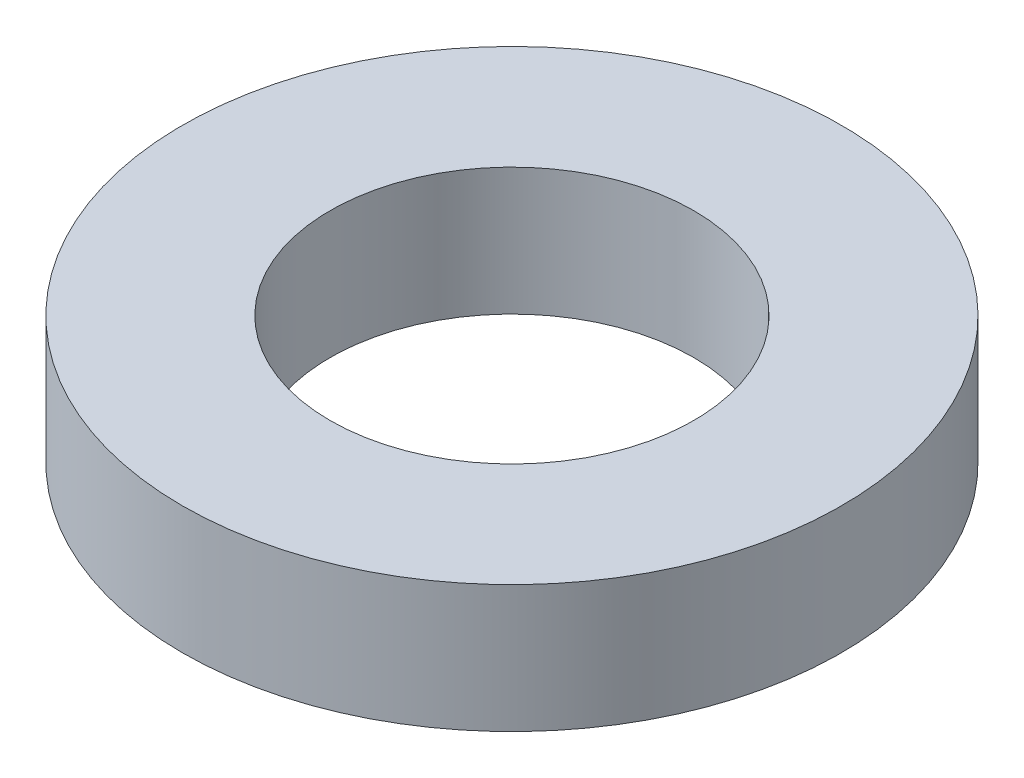
ISO-10303-21;
HEADER;
FILE_DESCRIPTION(('STEP AP214'),'2;1');
FILE_NAME('part.step','',(''),(''),'','','');
FILE_SCHEMA(('AUTOMOTIVE_DESIGN { 1 0 10303 214 1 1 1 1 }'));
ENDSEC;
DATA;
#1=APPLICATION_CONTEXT('core data for automotive mechanical design processes');
#2=APPLICATION_PROTOCOL_DEFINITION('international standard','automotive_design',2000,#1);
#3=PRODUCT_CONTEXT('',#1,'mechanical');
#4=PRODUCT('Part','Part','',(#3));
#5=PRODUCT_RELATED_PRODUCT_CATEGORY('part','',(#4));
#6=PRODUCT_DEFINITION_FORMATION('','',#4);
#7=PRODUCT_DEFINITION_CONTEXT('part definition',#1,'design');
#8=PRODUCT_DEFINITION('design','',#6,#7);
#9=PRODUCT_DEFINITION_SHAPE('','',#8);
#10=(LENGTH_UNIT() NAMED_UNIT(*) SI_UNIT(.MILLI.,.METRE.));
#11=(NAMED_UNIT(*) PLANE_ANGLE_UNIT() SI_UNIT($,.RADIAN.));
#12=(NAMED_UNIT(*) SI_UNIT($,.STERADIAN.) SOLID_ANGLE_UNIT());
#13=UNCERTAINTY_MEASURE_WITH_UNIT(LENGTH_MEASURE(1.E-05),#10,'distance_accuracy_value','');
#14=(GEOMETRIC_REPRESENTATION_CONTEXT(3) GLOBAL_UNCERTAINTY_ASSIGNED_CONTEXT((#13)) GLOBAL_UNIT_ASSIGNED_CONTEXT((#10,
#11,#12)) REPRESENTATION_CONTEXT('',''));
#15=CARTESIAN_POINT('',(0.,0.,0.));
#16=DIRECTION('',(0.,0.,1.));
#17=DIRECTION('',(1.,0.,0.));
#18=AXIS2_PLACEMENT_3D('',#15,#16,#17);
#19=CARTESIAN_POINT('',(0.,28.,0.));
#20=DIRECTION('',(0.,-1.,0.));
#21=DIRECTION('',(0.,0.,-1.));
#22=AXIS2_PLACEMENT_3D('',#19,#20,#21);
#23=CYLINDRICAL_SURFACE('',#22,72.5);
#24=CARTESIAN_POINT('',(0.,28.,0.));
#25=DIRECTION('',(0.,1.,0.));
#26=DIRECTION('',(0.,0.,1.));
#27=AXIS2_PLACEMENT_3D('',#24,#25,#26);
#28=CIRCLE('',#27,72.5);
#29=CARTESIAN_POINT('',(0.,28.,72.5));
#30=VERTEX_POINT('',#29);
#31=EDGE_CURVE('E10',#30,#30,#28,.T.);
#32=ORIENTED_EDGE('',*,*,#31,.F.);
#33=EDGE_LOOP('',(#32));
#34=FACE_BOUND('',#33,.T.);
#35=CARTESIAN_POINT('',(0.,0.,0.));
#36=DIRECTION('',(0.,1.,0.));
#37=DIRECTION('',(0.,0.,1.));
#38=AXIS2_PLACEMENT_3D('',#35,#36,#37);
#39=CIRCLE('',#38,72.5);
#40=CARTESIAN_POINT('',(0.,0.,72.5));
#41=VERTEX_POINT('',#40);
#42=EDGE_CURVE('E37',#41,#41,#39,.T.);
#43=ORIENTED_EDGE('',*,*,#42,.T.);
#44=EDGE_LOOP('',(#43));
#45=FACE_BOUND('',#44,.T.);
#46=ADVANCED_FACE('F40',(#34,#45),#23,.T.);
#47=CARTESIAN_POINT('',(0.,28.,0.));
#48=DIRECTION('',(0.,1.,0.));
#49=DIRECTION('',(0.,0.,1.));
#50=AXIS2_PLACEMENT_3D('',#47,#48,#49);
#51=PLANE('',#50);
#52=CARTESIAN_POINT('',(0.,28.,0.));
#53=DIRECTION('',(0.,1.,0.));
#54=DIRECTION('',(0.,0.,1.));
#55=AXIS2_PLACEMENT_3D('',#52,#53,#54);
#56=CIRCLE('',#55,40.);
#57=CARTESIAN_POINT('',(0.,28.,40.));
#58=VERTEX_POINT('',#57);
#59=EDGE_CURVE('E50',#58,#58,#56,.T.);
#60=ORIENTED_EDGE('',*,*,#59,.F.);
#61=EDGE_LOOP('',(#60));
#62=FACE_BOUND('',#61,.T.);
#63=ORIENTED_EDGE('',*,*,#31,.T.);
#64=EDGE_LOOP('',(#63));
#65=FACE_BOUND('',#64,.T.);
#66=ADVANCED_FACE('F59',(#62,#65),#51,.T.);
#67=CARTESIAN_POINT('',(0.,0.,0.));
#68=DIRECTION('',(0.,1.,0.));
#69=DIRECTION('',(0.,0.,1.));
#70=AXIS2_PLACEMENT_3D('',#67,#68,#69);
#71=PLANE('',#70);
#72=CARTESIAN_POINT('',(0.,0.,0.));
#73=DIRECTION('',(0.,1.,0.));
#74=DIRECTION('',(0.,0.,1.));
#75=AXIS2_PLACEMENT_3D('',#72,#73,#74);
#76=CIRCLE('',#75,40.);
#77=CARTESIAN_POINT('',(0.,0.,40.));
#78=VERTEX_POINT('',#77);
#79=EDGE_CURVE('E47',#78,#78,#76,.T.);
#80=ORIENTED_EDGE('',*,*,#79,.T.);
#81=EDGE_LOOP('',(#80));
#82=FACE_BOUND('',#81,.T.);
#83=ORIENTED_EDGE('',*,*,#42,.F.);
#84=EDGE_LOOP('',(#83));
#85=FACE_BOUND('',#84,.T.);
#86=ADVANCED_FACE('F58',(#82,#85),#71,.F.);
#87=CARTESIAN_POINT('',(0.,28.,0.));
#88=DIRECTION('',(0.,-1.,0.));
#89=DIRECTION('',(0.,0.,-1.));
#90=AXIS2_PLACEMENT_3D('',#87,#88,#89);
#91=CYLINDRICAL_SURFACE('',#90,40.);
#92=ORIENTED_EDGE('',*,*,#59,.T.);
#93=EDGE_LOOP('',(#92));
#94=FACE_BOUND('',#93,.T.);
#95=ORIENTED_EDGE('',*,*,#79,.F.);
#96=EDGE_LOOP('',(#95));
#97=FACE_BOUND('',#96,.T.);
#98=ADVANCED_FACE('F54',(#94,#97),#91,.F.);
#99=CLOSED_SHELL('',(#46,#66,#86,#98));
#100=MANIFOLD_SOLID_BREP('B2',#99);
#101=ADVANCED_BREP_SHAPE_REPRESENTATION('',(#18,#100),#14);
#102=SHAPE_DEFINITION_REPRESENTATION(#9,#101);
ENDSEC;
END-ISO-10303-21;
